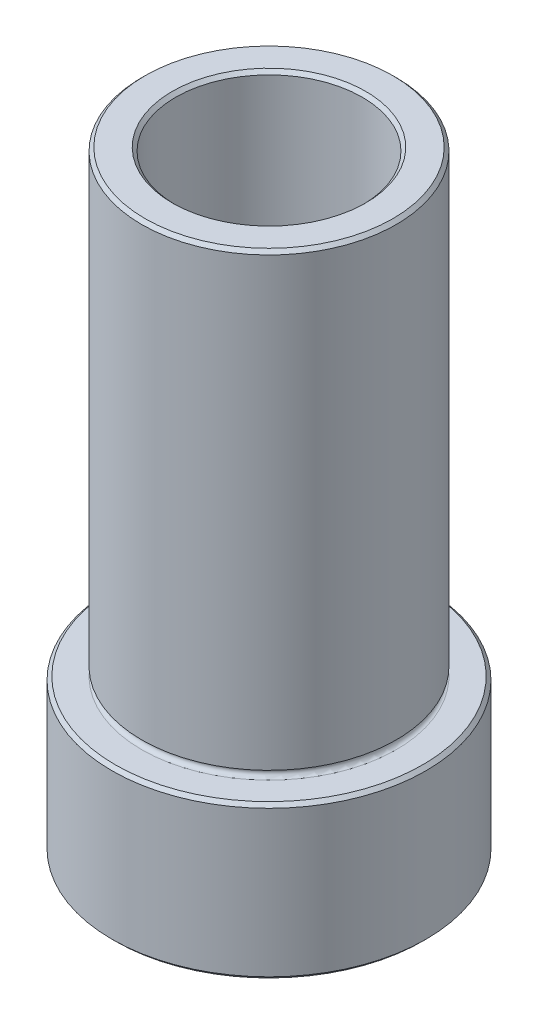
ISO-10303-21;
HEADER;
FILE_DESCRIPTION(('STEP AP214'),'2;1');
FILE_NAME('part.step','',(''),(''),'','','');
FILE_SCHEMA(('AUTOMOTIVE_DESIGN { 1 0 10303 214 1 1 1 1 }'));
ENDSEC;
DATA;
#1=APPLICATION_CONTEXT('core data for automotive mechanical design processes');
#2=APPLICATION_PROTOCOL_DEFINITION('international standard','automotive_design',2000,#1);
#3=PRODUCT_CONTEXT('',#1,'mechanical');
#4=PRODUCT('Part','Part','',(#3));
#5=PRODUCT_RELATED_PRODUCT_CATEGORY('part','',(#4));
#6=PRODUCT_DEFINITION_FORMATION('','',#4);
#7=PRODUCT_DEFINITION_CONTEXT('part definition',#1,'design');
#8=PRODUCT_DEFINITION('design','',#6,#7);
#9=PRODUCT_DEFINITION_SHAPE('','',#8);
#10=(LENGTH_UNIT() NAMED_UNIT(*) SI_UNIT(.MILLI.,.METRE.));
#11=(NAMED_UNIT(*) PLANE_ANGLE_UNIT() SI_UNIT($,.RADIAN.));
#12=(NAMED_UNIT(*) SI_UNIT($,.STERADIAN.) SOLID_ANGLE_UNIT());
#13=UNCERTAINTY_MEASURE_WITH_UNIT(LENGTH_MEASURE(1.E-05),#10,'distance_accuracy_value','');
#14=(GEOMETRIC_REPRESENTATION_CONTEXT(3) GLOBAL_UNCERTAINTY_ASSIGNED_CONTEXT((#13)) GLOBAL_UNIT_ASSIGNED_CONTEXT((#10,
#11,#12)) REPRESENTATION_CONTEXT('',''));
#15=CARTESIAN_POINT('',(0.,0.,0.));
#16=DIRECTION('',(0.,0.,1.));
#17=DIRECTION('',(1.,0.,0.));
#18=AXIS2_PLACEMENT_3D('',#15,#16,#17);
#19=CARTESIAN_POINT('',(0.,9.,0.));
#20=DIRECTION('',(0.,1.,0.));
#21=DIRECTION('',(0.,0.,1.));
#22=AXIS2_PLACEMENT_3D('',#19,#20,#21);
#23=PLANE('',#22);
#24=CARTESIAN_POINT('',(0.,9.,0.));
#25=DIRECTION('',(0.,1.,0.));
#26=DIRECTION('',(0.,0.,1.));
#27=AXIS2_PLACEMENT_3D('',#24,#25,#26);
#28=CIRCLE('',#27,9.05000000000001);
#29=CARTESIAN_POINT('',(0.,9.,9.05000000000001));
#30=VERTEX_POINT('',#29);
#31=EDGE_CURVE('E10',#30,#30,#28,.T.);
#32=ORIENTED_EDGE('',*,*,#31,.T.);
#33=EDGE_LOOP('',(#32));
#34=FACE_BOUND('',#33,.T.);
#35=CARTESIAN_POINT('',(0.,9.,0.));
#36=DIRECTION('',(0.,1.,0.));
#37=DIRECTION('',(0.,0.,1.));
#38=AXIS2_PLACEMENT_3D('',#35,#36,#37);
#39=CIRCLE('',#38,7.5);
#40=CARTESIAN_POINT('',(0.,9.,7.5));
#41=VERTEX_POINT('',#40);
#42=EDGE_CURVE('E70',#41,#41,#39,.F.);
#43=ORIENTED_EDGE('',*,*,#42,.T.);
#44=EDGE_LOOP('',(#43));
#45=FACE_BOUND('',#44,.T.);
#46=ADVANCED_FACE('F32',(#34,#45),#23,.T.);
#47=CARTESIAN_POINT('',(0.,9.,0.));
#48=DIRECTION('',(0.,-1.,0.));
#49=DIRECTION('',(0.,0.,-1.));
#50=AXIS2_PLACEMENT_3D('',#47,#48,#49);
#51=CYLINDRICAL_SURFACE('',#50,9.25);
#52=CARTESIAN_POINT('',(0.,0.200000000000004,0.));
#53=DIRECTION('',(0.,1.,0.));
#54=DIRECTION('',(0.,0.,1.));
#55=AXIS2_PLACEMENT_3D('',#52,#53,#54);
#56=CIRCLE('',#55,9.25);
#57=CARTESIAN_POINT('',(0.,0.200000000000004,9.25));
#58=VERTEX_POINT('',#57);
#59=EDGE_CURVE('E40',#58,#58,#56,.T.);
#60=ORIENTED_EDGE('',*,*,#59,.T.);
#61=EDGE_LOOP('',(#60));
#62=FACE_BOUND('',#61,.T.);
#63=CARTESIAN_POINT('',(0.,8.80000000000001,0.));
#64=DIRECTION('',(0.,1.,0.));
#65=DIRECTION('',(0.,0.,1.));
#66=AXIS2_PLACEMENT_3D('',#63,#64,#65);
#67=CIRCLE('',#66,9.25);
#68=CARTESIAN_POINT('',(0.,8.80000000000001,9.25));
#69=VERTEX_POINT('',#68);
#70=EDGE_CURVE('E44',#69,#69,#67,.F.);
#71=ORIENTED_EDGE('',*,*,#70,.T.);
#72=EDGE_LOOP('',(#71));
#73=FACE_BOUND('',#72,.T.);
#74=ADVANCED_FACE('F91',(#62,#73),#51,.T.);
#75=CARTESIAN_POINT('',(0.,0.,0.));
#76=DIRECTION('',(0.,1.,0.));
#77=DIRECTION('',(0.,0.,1.));
#78=AXIS2_PLACEMENT_3D('',#75,#76,#77);
#79=PLANE('',#78);
#80=CARTESIAN_POINT('',(0.,0.,0.));
#81=DIRECTION('',(0.,1.,0.));
#82=DIRECTION('',(0.,0.,1.));
#83=AXIS2_PLACEMENT_3D('',#80,#81,#82);
#84=CIRCLE('',#83,5.7);
#85=CARTESIAN_POINT('',(0.,0.,5.7));
#86=VERTEX_POINT('',#85);
#87=EDGE_CURVE('E58',#86,#86,#84,.T.);
#88=ORIENTED_EDGE('',*,*,#87,.T.);
#89=EDGE_LOOP('',(#88));
#90=FACE_BOUND('',#89,.T.);
#91=CARTESIAN_POINT('',(0.,0.,0.));
#92=DIRECTION('',(0.,1.,0.));
#93=DIRECTION('',(0.,0.,1.));
#94=AXIS2_PLACEMENT_3D('',#91,#92,#93);
#95=CIRCLE('',#94,9.05);
#96=CARTESIAN_POINT('',(0.,0.,9.05));
#97=VERTEX_POINT('',#96);
#98=EDGE_CURVE('E61',#97,#97,#95,.F.);
#99=ORIENTED_EDGE('',*,*,#98,.T.);
#100=EDGE_LOOP('',(#99));
#101=FACE_BOUND('',#100,.T.);
#102=ADVANCED_FACE('F96',(#90,#101),#79,.F.);
#103=CARTESIAN_POINT('',(0.,36.,0.));
#104=DIRECTION('',(0.,-1.,0.));
#105=DIRECTION('',(0.,0.,-1.));
#106=AXIS2_PLACEMENT_3D('',#103,#104,#105);
#107=CYLINDRICAL_SURFACE('',#106,7.5);
#108=CARTESIAN_POINT('',(0.,9.5,0.));
#109=DIRECTION('',(0.,-1.,0.));
#110=DIRECTION('',(0.,0.,-1.));
#111=AXIS2_PLACEMENT_3D('',#108,#109,#110);
#112=CIRCLE('',#111,7.5);
#113=CARTESIAN_POINT('',(0.,9.5,-7.5));
#114=VERTEX_POINT('',#113);
#115=EDGE_CURVE('E36',#114,#114,#112,.F.);
#116=ORIENTED_EDGE('',*,*,#115,.T.);
#117=EDGE_LOOP('',(#116));
#118=FACE_BOUND('',#117,.T.);
#119=CARTESIAN_POINT('',(0.,35.8,0.));
#120=DIRECTION('',(0.,1.,0.));
#121=DIRECTION('',(0.,0.,1.));
#122=AXIS2_PLACEMENT_3D('',#119,#120,#121);
#123=CIRCLE('',#122,7.5);
#124=CARTESIAN_POINT('',(0.,35.8,7.5));
#125=VERTEX_POINT('',#124);
#126=EDGE_CURVE('E49',#125,#125,#123,.F.);
#127=ORIENTED_EDGE('',*,*,#126,.T.);
#128=EDGE_LOOP('',(#127));
#129=FACE_BOUND('',#128,.T.);
#130=ADVANCED_FACE('F77',(#118,#129),#107,.T.);
#131=CARTESIAN_POINT('',(0.,36.,0.));
#132=DIRECTION('',(0.,1.,0.));
#133=DIRECTION('',(0.,0.,1.));
#134=AXIS2_PLACEMENT_3D('',#131,#132,#133);
#135=PLANE('',#134);
#136=CARTESIAN_POINT('',(0.,36.,0.));
#137=DIRECTION('',(0.,1.,0.));
#138=DIRECTION('',(0.,0.,1.));
#139=AXIS2_PLACEMENT_3D('',#136,#137,#138);
#140=CIRCLE('',#139,5.69999999999999);
#141=CARTESIAN_POINT('',(0.,36.,5.69999999999999));
#142=VERTEX_POINT('',#141);
#143=EDGE_CURVE('E52',#142,#142,#140,.F.);
#144=ORIENTED_EDGE('',*,*,#143,.T.);
#145=EDGE_LOOP('',(#144));
#146=FACE_BOUND('',#145,.T.);
#147=CARTESIAN_POINT('',(0.,36.,0.));
#148=DIRECTION('',(0.,1.,0.));
#149=DIRECTION('',(0.,0.,1.));
#150=AXIS2_PLACEMENT_3D('',#147,#148,#149);
#151=CIRCLE('',#150,7.29999999999999);
#152=CARTESIAN_POINT('',(0.,36.,7.29999999999999));
#153=VERTEX_POINT('',#152);
#154=EDGE_CURVE('E55',#153,#153,#151,.T.);
#155=ORIENTED_EDGE('',*,*,#154,.T.);
#156=EDGE_LOOP('',(#155));
#157=FACE_BOUND('',#156,.T.);
#158=ADVANCED_FACE('F143',(#146,#157),#135,.T.);
#159=CARTESIAN_POINT('',(0.,40.,0.));
#160=DIRECTION('',(0.,-1.,0.));
#161=DIRECTION('',(0.,0.,-1.));
#162=AXIS2_PLACEMENT_3D('',#159,#160,#161);
#163=CYLINDRICAL_SURFACE('',#162,5.5);
#164=CARTESIAN_POINT('',(0.,0.199999999999999,0.));
#165=DIRECTION('',(0.,1.,0.));
#166=DIRECTION('',(0.,0.,1.));
#167=AXIS2_PLACEMENT_3D('',#164,#165,#166);
#168=CIRCLE('',#167,5.5);
#169=CARTESIAN_POINT('',(0.,0.199999999999999,5.5));
#170=VERTEX_POINT('',#169);
#171=EDGE_CURVE('E64',#170,#170,#168,.F.);
#172=ORIENTED_EDGE('',*,*,#171,.T.);
#173=EDGE_LOOP('',(#172));
#174=FACE_BOUND('',#173,.T.);
#175=CARTESIAN_POINT('',(0.,35.8,0.));
#176=DIRECTION('',(0.,1.,0.));
#177=DIRECTION('',(0.,0.,1.));
#178=AXIS2_PLACEMENT_3D('',#175,#176,#177);
#179=CIRCLE('',#178,5.5);
#180=CARTESIAN_POINT('',(0.,35.8,5.5));
#181=VERTEX_POINT('',#180);
#182=EDGE_CURVE('E67',#181,#181,#179,.T.);
#183=ORIENTED_EDGE('',*,*,#182,.T.);
#184=EDGE_LOOP('',(#183));
#185=FACE_BOUND('',#184,.T.);
#186=ADVANCED_FACE('F109',(#174,#185),#163,.F.);
#187=CARTESIAN_POINT('',(0.,0.199999999999999,0.));
#188=DIRECTION('',(0.,-1.,0.));
#189=DIRECTION('',(0.,0.,-1.));
#190=AXIS2_PLACEMENT_3D('',#187,#188,#189);
#191=CONICAL_SURFACE('',#190,5.5,0.785398163397444);
#192=ORIENTED_EDGE('',*,*,#87,.F.);
#193=EDGE_LOOP('',(#192));
#194=FACE_BOUND('',#193,.T.);
#195=ORIENTED_EDGE('',*,*,#171,.F.);
#196=EDGE_LOOP('',(#195));
#197=FACE_BOUND('',#196,.T.);
#198=ADVANCED_FACE('F105',(#194,#197),#191,.F.);
#199=CARTESIAN_POINT('',(0.,35.8,0.));
#200=DIRECTION('',(0.,1.,0.));
#201=DIRECTION('',(0.,0.,1.));
#202=AXIS2_PLACEMENT_3D('',#199,#200,#201);
#203=CONICAL_SURFACE('',#202,5.5,0.785398163397444);
#204=ORIENTED_EDGE('',*,*,#143,.F.);
#205=EDGE_LOOP('',(#204));
#206=FACE_BOUND('',#205,.T.);
#207=ORIENTED_EDGE('',*,*,#182,.F.);
#208=EDGE_LOOP('',(#207));
#209=FACE_BOUND('',#208,.T.);
#210=ADVANCED_FACE('F108',(#206,#209),#203,.F.);
#211=CARTESIAN_POINT('',(0.,36.,0.));
#212=DIRECTION('',(0.,-1.,0.));
#213=DIRECTION('',(0.,0.,-1.));
#214=AXIS2_PLACEMENT_3D('',#211,#212,#213);
#215=CONICAL_SURFACE('',#214,7.29999999999999,0.785398163397448);
#216=ORIENTED_EDGE('',*,*,#126,.F.);
#217=EDGE_LOOP('',(#216));
#218=FACE_BOUND('',#217,.T.);
#219=ORIENTED_EDGE('',*,*,#154,.F.);
#220=EDGE_LOOP('',(#219));
#221=FACE_BOUND('',#220,.T.);
#222=ADVANCED_FACE('F113',(#218,#221),#215,.T.);
#223=CARTESIAN_POINT('',(0.,0.200000000000004,0.));
#224=DIRECTION('',(0.,1.,0.));
#225=DIRECTION('',(0.,0.,1.));
#226=AXIS2_PLACEMENT_3D('',#223,#224,#225);
#227=CONICAL_SURFACE('',#226,9.25,0.785398163397448);
#228=ORIENTED_EDGE('',*,*,#98,.F.);
#229=EDGE_LOOP('',(#228));
#230=FACE_BOUND('',#229,.T.);
#231=ORIENTED_EDGE('',*,*,#59,.F.);
#232=EDGE_LOOP('',(#231));
#233=FACE_BOUND('',#232,.T.);
#234=ADVANCED_FACE('F87',(#230,#233),#227,.T.);
#235=CARTESIAN_POINT('',(0.,9.,0.));
#236=DIRECTION('',(0.,-1.,0.));
#237=DIRECTION('',(0.,0.,-1.));
#238=AXIS2_PLACEMENT_3D('',#235,#236,#237);
#239=CONICAL_SURFACE('',#238,9.05000000000001,0.78539816339744);
#240=ORIENTED_EDGE('',*,*,#70,.F.);
#241=EDGE_LOOP('',(#240));
#242=FACE_BOUND('',#241,.T.);
#243=ORIENTED_EDGE('',*,*,#31,.F.);
#244=EDGE_LOOP('',(#243));
#245=FACE_BOUND('',#244,.T.);
#246=ADVANCED_FACE('F34',(#242,#245),#239,.T.);
#247=CARTESIAN_POINT('',(0.,9.25,0.));
#248=DIRECTION('',(0.,1.,0.));
#249=DIRECTION('',(0.,0.,1.));
#250=AXIS2_PLACEMENT_3D('',#247,#248,#249);
#251=TOROIDAL_SURFACE('',#250,7.5,0.25);
#252=ORIENTED_EDGE('',*,*,#42,.F.);
#253=EDGE_LOOP('',(#252));
#254=FACE_BOUND('',#253,.T.);
#255=ORIENTED_EDGE('',*,*,#115,.F.);
#256=EDGE_LOOP('',(#255));
#257=FACE_BOUND('',#256,.T.);
#258=ADVANCED_FACE('F80',(#254,#257),#251,.F.);
#259=CLOSED_SHELL('',(#46,#74,#102,#130,#158,#186,#198,#210,#222,#234,#246,#258));
#260=MANIFOLD_SOLID_BREP('B2',#259);
#261=ADVANCED_BREP_SHAPE_REPRESENTATION('',(#18,#260),#14);
#262=SHAPE_DEFINITION_REPRESENTATION(#9,#261);
ENDSEC;
END-ISO-10303-21;
